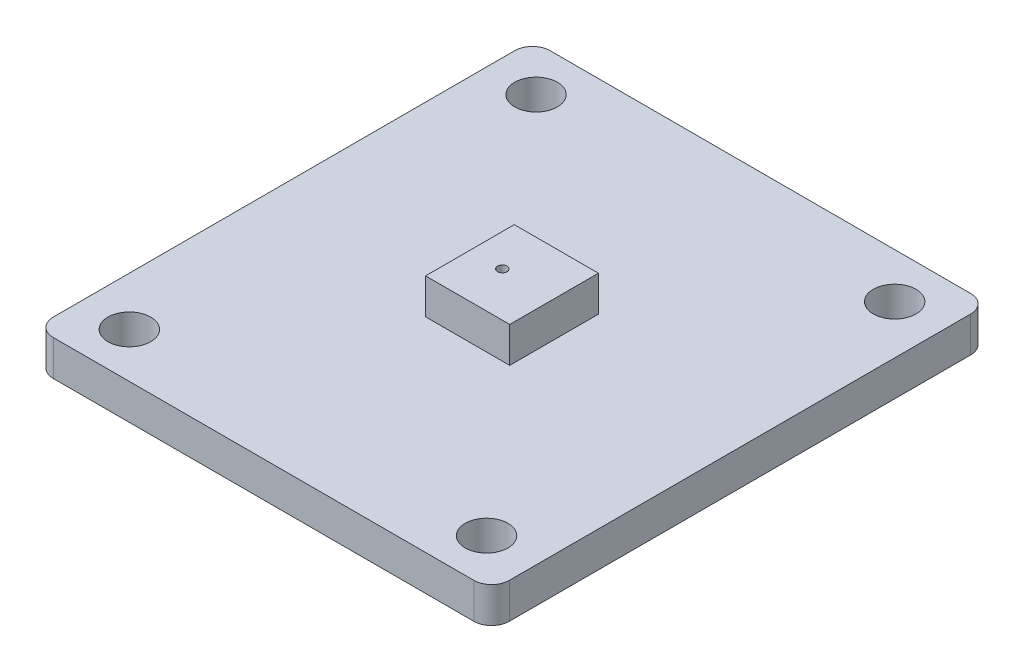
ISO-10303-21;
HEADER;
FILE_DESCRIPTION(('STEP AP214'),'2;1');
FILE_NAME('part.step','',(''),(''),'','','');
FILE_SCHEMA(('AUTOMOTIVE_DESIGN { 1 0 10303 214 1 1 1 1 }'));
ENDSEC;
DATA;
#1=APPLICATION_CONTEXT('core data for automotive mechanical design processes');
#2=APPLICATION_PROTOCOL_DEFINITION('international standard','automotive_design',2000,#1);
#3=PRODUCT_CONTEXT('',#1,'mechanical');
#4=PRODUCT('Part','Part','',(#3));
#5=PRODUCT_RELATED_PRODUCT_CATEGORY('part','',(#4));
#6=PRODUCT_DEFINITION_FORMATION('','',#4);
#7=PRODUCT_DEFINITION_CONTEXT('part definition',#1,'design');
#8=PRODUCT_DEFINITION('design','',#6,#7);
#9=PRODUCT_DEFINITION_SHAPE('','',#8);
#10=(LENGTH_UNIT() NAMED_UNIT(*) SI_UNIT(.MILLI.,.METRE.));
#11=(NAMED_UNIT(*) PLANE_ANGLE_UNIT() SI_UNIT($,.RADIAN.));
#12=(NAMED_UNIT(*) SI_UNIT($,.STERADIAN.) SOLID_ANGLE_UNIT());
#13=UNCERTAINTY_MEASURE_WITH_UNIT(LENGTH_MEASURE(1.E-05),#10,'distance_accuracy_value','');
#14=(GEOMETRIC_REPRESENTATION_CONTEXT(3) GLOBAL_UNCERTAINTY_ASSIGNED_CONTEXT((#13)) GLOBAL_UNIT_ASSIGNED_CONTEXT((#10,
#11,#12)) REPRESENTATION_CONTEXT('',''));
#15=CARTESIAN_POINT('',(0.,0.,0.));
#16=DIRECTION('',(0.,0.,1.));
#17=DIRECTION('',(1.,0.,0.));
#18=AXIS2_PLACEMENT_3D('',#15,#16,#17);
#19=CARTESIAN_POINT('',(-11.85,2.,13.));
#20=DIRECTION('',(0.,1.,0.));
#21=DIRECTION('',(0.,0.,1.));
#22=AXIS2_PLACEMENT_3D('',#19,#20,#21);
#23=PLANE('',#22);
#24=DIRECTION('',(-1.,0.,0.));
#25=VECTOR('',#24,1.);
#26=CARTESIAN_POINT('',(-11.85,2.,2.5));
#27=LINE('',#26,#25);
#28=CARTESIAN_POINT('',(2.37,2.,2.5));
#29=VERTEX_POINT('',#28);
#30=CARTESIAN_POINT('',(-2.36999999999999,2.,2.5));
#31=VERTEX_POINT('',#30);
#32=EDGE_CURVE('E222',#29,#31,#27,.T.);
#33=ORIENTED_EDGE('',*,*,#32,.T.);
#34=DIRECTION('',(0.,0.,-1.));
#35=VECTOR('',#34,1.);
#36=CARTESIAN_POINT('',(-2.36999999999999,2.,13.));
#37=LINE('',#36,#35);
#38=CARTESIAN_POINT('',(-2.36999999999999,2.,-2.5));
#39=VERTEX_POINT('',#38);
#40=EDGE_CURVE('E217',#31,#39,#37,.T.);
#41=ORIENTED_EDGE('',*,*,#40,.T.);
#42=DIRECTION('',(1.,0.,0.));
#43=VECTOR('',#42,1.);
#44=CARTESIAN_POINT('',(-11.85,2.,-2.5));
#45=LINE('',#44,#43);
#46=CARTESIAN_POINT('',(2.37,2.,-2.5));
#47=VERTEX_POINT('',#46);
#48=EDGE_CURVE('E228',#39,#47,#45,.T.);
#49=ORIENTED_EDGE('',*,*,#48,.T.);
#50=DIRECTION('',(0.,0.,1.));
#51=VECTOR('',#50,1.);
#52=CARTESIAN_POINT('',(2.37,2.,13.));
#53=LINE('',#52,#51);
#54=EDGE_CURVE('E225',#47,#29,#53,.T.);
#55=ORIENTED_EDGE('',*,*,#54,.T.);
#56=EDGE_LOOP('',(#33,#41,#49,#55));
#57=FACE_BOUND('',#56,.T.);
#58=CARTESIAN_POINT('',(10.026555831626,2.,11.46));
#59=DIRECTION('',(0.,1.,0.));
#60=DIRECTION('',(0.,0.,1.));
#61=AXIS2_PLACEMENT_3D('',#58,#59,#60);
#62=CIRCLE('',#61,1.205);
#63=CARTESIAN_POINT('',(10.026555831626,2.,12.665));
#64=VERTEX_POINT('',#63);
#65=EDGE_CURVE('E205',#64,#64,#62,.T.);
#66=ORIENTED_EDGE('',*,*,#65,.F.);
#67=EDGE_LOOP('',(#66));
#68=FACE_BOUND('',#67,.T.);
#69=CARTESIAN_POINT('',(-10.105,2.,-11.46));
#70=DIRECTION('',(0.,1.,0.));
#71=DIRECTION('',(0.,0.,1.));
#72=AXIS2_PLACEMENT_3D('',#69,#70,#71);
#73=CIRCLE('',#72,1.205);
#74=CARTESIAN_POINT('',(-10.105,2.,-10.255));
#75=VERTEX_POINT('',#74);
#76=EDGE_CURVE('E147',#75,#75,#73,.T.);
#77=ORIENTED_EDGE('',*,*,#76,.F.);
#78=EDGE_LOOP('',(#77));
#79=FACE_BOUND('',#78,.T.);
#80=CARTESIAN_POINT('',(-11.85,2.,13.));
#81=DIRECTION('',(0.,1.,0.));
#82=DIRECTION('',(0.,0.,1.));
#83=AXIS2_PLACEMENT_3D('',#80,#81,#82);
#84=CIRCLE('',#83,1.);
#85=CARTESIAN_POINT('',(-12.85,2.,13.));
#86=VERTEX_POINT('',#85);
#87=CARTESIAN_POINT('',(-11.85,2.,14.));
#88=VERTEX_POINT('',#87);
#89=EDGE_CURVE('E159',#86,#88,#84,.T.);
#90=ORIENTED_EDGE('',*,*,#89,.T.);
#91=DIRECTION('',(1.,0.,0.));
#92=VECTOR('',#91,1.);
#93=CARTESIAN_POINT('',(-11.85,2.,14.));
#94=LINE('',#93,#92);
#95=CARTESIAN_POINT('',(11.85,2.,14.));
#96=VERTEX_POINT('',#95);
#97=EDGE_CURVE('E100',#88,#96,#94,.T.);
#98=ORIENTED_EDGE('',*,*,#97,.T.);
#99=CARTESIAN_POINT('',(11.85,2.,13.));
#100=DIRECTION('',(0.,1.,0.));
#101=DIRECTION('',(0.,0.,1.));
#102=AXIS2_PLACEMENT_3D('',#99,#100,#101);
#103=CIRCLE('',#102,1.);
#104=CARTESIAN_POINT('',(12.85,2.,13.));
#105=VERTEX_POINT('',#104);
#106=EDGE_CURVE('E190',#96,#105,#103,.T.);
#107=ORIENTED_EDGE('',*,*,#106,.T.);
#108=DIRECTION('',(0.,0.,-1.));
#109=VECTOR('',#108,1.);
#110=CARTESIAN_POINT('',(12.85,2.,-13.));
#111=LINE('',#110,#109);
#112=CARTESIAN_POINT('',(12.85,2.,-13.));
#113=VERTEX_POINT('',#112);
#114=EDGE_CURVE('E189',#105,#113,#111,.T.);
#115=ORIENTED_EDGE('',*,*,#114,.T.);
#116=CARTESIAN_POINT('',(11.85,2.,-13.));
#117=DIRECTION('',(0.,1.,0.));
#118=DIRECTION('',(0.,0.,-1.));
#119=AXIS2_PLACEMENT_3D('',#116,#117,#118);
#120=CIRCLE('',#119,1.);
#121=CARTESIAN_POINT('',(11.85,2.,-14.));
#122=VERTEX_POINT('',#121);
#123=EDGE_CURVE('E122',#113,#122,#120,.T.);
#124=ORIENTED_EDGE('',*,*,#123,.T.);
#125=DIRECTION('',(-1.,0.,0.));
#126=VECTOR('',#125,1.);
#127=CARTESIAN_POINT('',(-11.85,2.,-14.));
#128=LINE('',#127,#126);
#129=CARTESIAN_POINT('',(-11.85,2.,-14.));
#130=VERTEX_POINT('',#129);
#131=EDGE_CURVE('E115',#122,#130,#128,.T.);
#132=ORIENTED_EDGE('',*,*,#131,.T.);
#133=CARTESIAN_POINT('',(-11.85,2.,-13.));
#134=DIRECTION('',(0.,1.,0.));
#135=DIRECTION('',(0.,0.,1.));
#136=AXIS2_PLACEMENT_3D('',#133,#134,#135);
#137=CIRCLE('',#136,1.);
#138=CARTESIAN_POINT('',(-12.85,2.,-13.));
#139=VERTEX_POINT('',#138);
#140=EDGE_CURVE('E119',#130,#139,#137,.T.);
#141=ORIENTED_EDGE('',*,*,#140,.T.);
#142=DIRECTION('',(0.,0.,1.));
#143=VECTOR('',#142,1.);
#144=CARTESIAN_POINT('',(-12.85,2.,-13.));
#145=LINE('',#144,#143);
#146=EDGE_CURVE('E58',#139,#86,#145,.T.);
#147=ORIENTED_EDGE('',*,*,#146,.T.);
#148=EDGE_LOOP('',(#90,#98,#107,#115,#124,#132,#141,#147));
#149=FACE_BOUND('',#148,.T.);
#150=CARTESIAN_POINT('',(-10.105,2.,11.46));
#151=DIRECTION('',(0.,1.,0.));
#152=DIRECTION('',(0.,0.,1.));
#153=AXIS2_PLACEMENT_3D('',#150,#151,#152);
#154=CIRCLE('',#153,1.205);
#155=CARTESIAN_POINT('',(-10.105,2.,12.665));
#156=VERTEX_POINT('',#155);
#157=EDGE_CURVE('E199',#156,#156,#154,.T.);
#158=ORIENTED_EDGE('',*,*,#157,.F.);
#159=EDGE_LOOP('',(#158));
#160=FACE_BOUND('',#159,.T.);
#161=CARTESIAN_POINT('',(10.105,2.,-11.46));
#162=DIRECTION('',(0.,1.,0.));
#163=DIRECTION('',(0.,0.,1.));
#164=AXIS2_PLACEMENT_3D('',#161,#162,#163);
#165=CIRCLE('',#164,1.205);
#166=CARTESIAN_POINT('',(10.105,2.,-10.255));
#167=VERTEX_POINT('',#166);
#168=EDGE_CURVE('E211',#167,#167,#165,.T.);
#169=ORIENTED_EDGE('',*,*,#168,.F.);
#170=EDGE_LOOP('',(#169));
#171=FACE_BOUND('',#170,.T.);
#172=ADVANCED_FACE('F33',(#57,#68,#79,#149,#160,#171),#23,.T.);
#173=CARTESIAN_POINT('',(-11.85,0.,13.));
#174=DIRECTION('',(0.,1.,0.));
#175=DIRECTION('',(0.,0.,1.));
#176=AXIS2_PLACEMENT_3D('',#173,#174,#175);
#177=PLANE('',#176);
#178=CARTESIAN_POINT('',(-11.85,0.,13.));
#179=DIRECTION('',(0.,1.,0.));
#180=DIRECTION('',(0.,0.,1.));
#181=AXIS2_PLACEMENT_3D('',#178,#179,#180);
#182=CIRCLE('',#181,1.);
#183=CARTESIAN_POINT('',(-12.85,0.,13.));
#184=VERTEX_POINT('',#183);
#185=CARTESIAN_POINT('',(-11.85,0.,14.));
#186=VERTEX_POINT('',#185);
#187=EDGE_CURVE('E143',#184,#186,#182,.T.);
#188=ORIENTED_EDGE('',*,*,#187,.F.);
#189=DIRECTION('',(0.,0.,1.));
#190=VECTOR('',#189,1.);
#191=CARTESIAN_POINT('',(-12.85,0.,-13.));
#192=LINE('',#191,#190);
#193=CARTESIAN_POINT('',(-12.85,0.,-13.));
#194=VERTEX_POINT('',#193);
#195=EDGE_CURVE('E91',#194,#184,#192,.T.);
#196=ORIENTED_EDGE('',*,*,#195,.F.);
#197=CARTESIAN_POINT('',(-11.85,0.,-13.));
#198=DIRECTION('',(0.,1.,0.));
#199=DIRECTION('',(0.,0.,1.));
#200=AXIS2_PLACEMENT_3D('',#197,#198,#199);
#201=CIRCLE('',#200,1.);
#202=CARTESIAN_POINT('',(-11.85,0.,-14.));
#203=VERTEX_POINT('',#202);
#204=EDGE_CURVE('E156',#203,#194,#201,.T.);
#205=ORIENTED_EDGE('',*,*,#204,.F.);
#206=DIRECTION('',(-1.,0.,0.));
#207=VECTOR('',#206,1.);
#208=CARTESIAN_POINT('',(-11.85,0.,-14.));
#209=LINE('',#208,#207);
#210=CARTESIAN_POINT('',(11.85,0.,-14.));
#211=VERTEX_POINT('',#210);
#212=EDGE_CURVE('E131',#211,#203,#209,.T.);
#213=ORIENTED_EDGE('',*,*,#212,.F.);
#214=CARTESIAN_POINT('',(11.85,0.,-13.));
#215=DIRECTION('',(0.,1.,0.));
#216=DIRECTION('',(0.,0.,-1.));
#217=AXIS2_PLACEMENT_3D('',#214,#215,#216);
#218=CIRCLE('',#217,1.);
#219=CARTESIAN_POINT('',(12.85,0.,-13.));
#220=VERTEX_POINT('',#219);
#221=EDGE_CURVE('E153',#220,#211,#218,.T.);
#222=ORIENTED_EDGE('',*,*,#221,.F.);
#223=DIRECTION('',(0.,0.,-1.));
#224=VECTOR('',#223,1.);
#225=CARTESIAN_POINT('',(12.85,0.,-13.));
#226=LINE('',#225,#224);
#227=CARTESIAN_POINT('',(12.85,0.,13.));
#228=VERTEX_POINT('',#227);
#229=EDGE_CURVE('E151',#228,#220,#226,.T.);
#230=ORIENTED_EDGE('',*,*,#229,.F.);
#231=CARTESIAN_POINT('',(11.85,0.,13.));
#232=DIRECTION('',(0.,1.,0.));
#233=DIRECTION('',(0.,0.,1.));
#234=AXIS2_PLACEMENT_3D('',#231,#232,#233);
#235=CIRCLE('',#234,1.);
#236=CARTESIAN_POINT('',(11.85,0.,14.));
#237=VERTEX_POINT('',#236);
#238=EDGE_CURVE('E149',#237,#228,#235,.T.);
#239=ORIENTED_EDGE('',*,*,#238,.F.);
#240=DIRECTION('',(1.,0.,0.));
#241=VECTOR('',#240,1.);
#242=CARTESIAN_POINT('',(-11.85,0.,14.));
#243=LINE('',#242,#241);
#244=EDGE_CURVE('E146',#186,#237,#243,.T.);
#245=ORIENTED_EDGE('',*,*,#244,.F.);
#246=EDGE_LOOP('',(#188,#196,#205,#213,#222,#230,#239,#245));
#247=FACE_BOUND('',#246,.T.);
#248=CARTESIAN_POINT('',(-10.105,0.,-11.46));
#249=DIRECTION('',(0.,1.,0.));
#250=DIRECTION('',(0.,0.,1.));
#251=AXIS2_PLACEMENT_3D('',#248,#249,#250);
#252=CIRCLE('',#251,1.205);
#253=CARTESIAN_POINT('',(-10.105,0.,-10.255));
#254=VERTEX_POINT('',#253);
#255=EDGE_CURVE('E196',#254,#254,#252,.T.);
#256=ORIENTED_EDGE('',*,*,#255,.T.);
#257=EDGE_LOOP('',(#256));
#258=FACE_BOUND('',#257,.T.);
#259=CARTESIAN_POINT('',(-10.105,0.,11.46));
#260=DIRECTION('',(0.,1.,0.));
#261=DIRECTION('',(0.,0.,1.));
#262=AXIS2_PLACEMENT_3D('',#259,#260,#261);
#263=CIRCLE('',#262,1.205);
#264=CARTESIAN_POINT('',(-10.105,0.,12.665));
#265=VERTEX_POINT('',#264);
#266=EDGE_CURVE('E202',#265,#265,#263,.T.);
#267=ORIENTED_EDGE('',*,*,#266,.T.);
#268=EDGE_LOOP('',(#267));
#269=FACE_BOUND('',#268,.T.);
#270=CARTESIAN_POINT('',(10.026555831626,0.,11.46));
#271=DIRECTION('',(0.,1.,0.));
#272=DIRECTION('',(0.,0.,1.));
#273=AXIS2_PLACEMENT_3D('',#270,#271,#272);
#274=CIRCLE('',#273,1.205);
#275=CARTESIAN_POINT('',(10.026555831626,0.,12.665));
#276=VERTEX_POINT('',#275);
#277=EDGE_CURVE('E208',#276,#276,#274,.T.);
#278=ORIENTED_EDGE('',*,*,#277,.T.);
#279=EDGE_LOOP('',(#278));
#280=FACE_BOUND('',#279,.T.);
#281=CARTESIAN_POINT('',(10.105,0.,-11.46));
#282=DIRECTION('',(0.,1.,0.));
#283=DIRECTION('',(0.,0.,1.));
#284=AXIS2_PLACEMENT_3D('',#281,#282,#283);
#285=CIRCLE('',#284,1.205);
#286=CARTESIAN_POINT('',(10.105,0.,-10.255));
#287=VERTEX_POINT('',#286);
#288=EDGE_CURVE('E214',#287,#287,#285,.T.);
#289=ORIENTED_EDGE('',*,*,#288,.T.);
#290=EDGE_LOOP('',(#289));
#291=FACE_BOUND('',#290,.T.);
#292=ADVANCED_FACE('F179',(#247,#258,#269,#280,#291),#177,.F.);
#293=CARTESIAN_POINT('',(-11.85,2.,13.));
#294=DIRECTION('',(0.,-1.,0.));
#295=DIRECTION('',(0.,0.,-1.));
#296=AXIS2_PLACEMENT_3D('',#293,#294,#295);
#297=CYLINDRICAL_SURFACE('',#296,1.);
#298=ORIENTED_EDGE('',*,*,#187,.T.);
#299=DIRECTION('',(0.,-1.,0.));
#300=VECTOR('',#299,1.);
#301=CARTESIAN_POINT('',(-11.85,2.,14.));
#302=LINE('',#301,#300);
#303=EDGE_CURVE('E37',#88,#186,#302,.T.);
#304=ORIENTED_EDGE('',*,*,#303,.F.);
#305=ORIENTED_EDGE('',*,*,#89,.F.);
#306=DIRECTION('',(0.,-1.,0.));
#307=VECTOR('',#306,1.);
#308=CARTESIAN_POINT('',(-12.85,2.,13.));
#309=LINE('',#308,#307);
#310=EDGE_CURVE('E139',#86,#184,#309,.T.);
#311=ORIENTED_EDGE('',*,*,#310,.T.);
#312=EDGE_LOOP('',(#298,#304,#305,#311));
#313=FACE_BOUND('',#312,.T.);
#314=ADVANCED_FACE('F35',(#313),#297,.T.);
#315=CARTESIAN_POINT('',(-11.85,2.,14.));
#316=DIRECTION('',(0.,0.,-1.));
#317=DIRECTION('',(-1.,0.,0.));
#318=AXIS2_PLACEMENT_3D('',#315,#316,#317);
#319=PLANE('',#318);
#320=ORIENTED_EDGE('',*,*,#244,.T.);
#321=DIRECTION('',(0.,-1.,0.));
#322=VECTOR('',#321,1.);
#323=CARTESIAN_POINT('',(11.85,2.,14.));
#324=LINE('',#323,#322);
#325=EDGE_CURVE('E168',#96,#237,#324,.T.);
#326=ORIENTED_EDGE('',*,*,#325,.F.);
#327=ORIENTED_EDGE('',*,*,#97,.F.);
#328=ORIENTED_EDGE('',*,*,#303,.T.);
#329=EDGE_LOOP('',(#320,#326,#327,#328));
#330=FACE_BOUND('',#329,.T.);
#331=ADVANCED_FACE('F174',(#330),#319,.F.);
#332=CARTESIAN_POINT('',(11.85,2.,13.));
#333=DIRECTION('',(0.,-1.,0.));
#334=DIRECTION('',(0.,0.,-1.));
#335=AXIS2_PLACEMENT_3D('',#332,#333,#334);
#336=CYLINDRICAL_SURFACE('',#335,1.);
#337=ORIENTED_EDGE('',*,*,#238,.T.);
#338=DIRECTION('',(0.,-1.,0.));
#339=VECTOR('',#338,1.);
#340=CARTESIAN_POINT('',(12.85,2.,13.));
#341=LINE('',#340,#339);
#342=EDGE_CURVE('E166',#105,#228,#341,.T.);
#343=ORIENTED_EDGE('',*,*,#342,.F.);
#344=ORIENTED_EDGE('',*,*,#106,.F.);
#345=ORIENTED_EDGE('',*,*,#325,.T.);
#346=EDGE_LOOP('',(#337,#343,#344,#345));
#347=FACE_BOUND('',#346,.T.);
#348=ADVANCED_FACE('F184',(#347),#336,.T.);
#349=CARTESIAN_POINT('',(12.85,2.,-13.));
#350=DIRECTION('',(-1.,0.,0.));
#351=DIRECTION('',(0.,0.,1.));
#352=AXIS2_PLACEMENT_3D('',#349,#350,#351);
#353=PLANE('',#352);
#354=ORIENTED_EDGE('',*,*,#229,.T.);
#355=DIRECTION('',(0.,-1.,0.));
#356=VECTOR('',#355,1.);
#357=CARTESIAN_POINT('',(12.85,2.,-13.));
#358=LINE('',#357,#356);
#359=EDGE_CURVE('E163',#113,#220,#358,.T.);
#360=ORIENTED_EDGE('',*,*,#359,.F.);
#361=ORIENTED_EDGE('',*,*,#114,.F.);
#362=ORIENTED_EDGE('',*,*,#342,.T.);
#363=EDGE_LOOP('',(#354,#360,#361,#362));
#364=FACE_BOUND('',#363,.T.);
#365=ADVANCED_FACE('F187',(#364),#353,.F.);
#366=CARTESIAN_POINT('',(11.85,2.,-13.));
#367=DIRECTION('',(0.,-1.,0.));
#368=DIRECTION('',(0.,0.,-1.));
#369=AXIS2_PLACEMENT_3D('',#366,#367,#368);
#370=CYLINDRICAL_SURFACE('',#369,1.);
#371=ORIENTED_EDGE('',*,*,#221,.T.);
#372=DIRECTION('',(0.,-1.,0.));
#373=VECTOR('',#372,1.);
#374=CARTESIAN_POINT('',(11.85,2.,-14.));
#375=LINE('',#374,#373);
#376=EDGE_CURVE('E134',#122,#211,#375,.T.);
#377=ORIENTED_EDGE('',*,*,#376,.F.);
#378=ORIENTED_EDGE('',*,*,#123,.F.);
#379=ORIENTED_EDGE('',*,*,#359,.T.);
#380=EDGE_LOOP('',(#371,#377,#378,#379));
#381=FACE_BOUND('',#380,.T.);
#382=ADVANCED_FACE('F342',(#381),#370,.T.);
#383=CARTESIAN_POINT('',(-11.85,2.,-14.));
#384=DIRECTION('',(0.,0.,1.));
#385=DIRECTION('',(1.,0.,0.));
#386=AXIS2_PLACEMENT_3D('',#383,#384,#385);
#387=PLANE('',#386);
#388=ORIENTED_EDGE('',*,*,#212,.T.);
#389=DIRECTION('',(0.,-1.,0.));
#390=VECTOR('',#389,1.);
#391=CARTESIAN_POINT('',(-11.85,2.,-14.));
#392=LINE('',#391,#390);
#393=EDGE_CURVE('E128',#130,#203,#392,.T.);
#394=ORIENTED_EDGE('',*,*,#393,.F.);
#395=ORIENTED_EDGE('',*,*,#131,.F.);
#396=ORIENTED_EDGE('',*,*,#376,.T.);
#397=EDGE_LOOP('',(#388,#394,#395,#396));
#398=FACE_BOUND('',#397,.T.);
#399=ADVANCED_FACE('F129',(#398),#387,.F.);
#400=CARTESIAN_POINT('',(-11.85,2.,-13.));
#401=DIRECTION('',(0.,-1.,0.));
#402=DIRECTION('',(0.,0.,-1.));
#403=AXIS2_PLACEMENT_3D('',#400,#401,#402);
#404=CYLINDRICAL_SURFACE('',#403,1.);
#405=ORIENTED_EDGE('',*,*,#204,.T.);
#406=DIRECTION('',(0.,-1.,0.));
#407=VECTOR('',#406,1.);
#408=CARTESIAN_POINT('',(-12.85,2.,-13.));
#409=LINE('',#408,#407);
#410=EDGE_CURVE('E135',#139,#194,#409,.T.);
#411=ORIENTED_EDGE('',*,*,#410,.F.);
#412=ORIENTED_EDGE('',*,*,#140,.F.);
#413=ORIENTED_EDGE('',*,*,#393,.T.);
#414=EDGE_LOOP('',(#405,#411,#412,#413));
#415=FACE_BOUND('',#414,.T.);
#416=ADVANCED_FACE('F137',(#415),#404,.T.);
#417=CARTESIAN_POINT('',(-12.85,2.,-13.));
#418=DIRECTION('',(1.,0.,0.));
#419=DIRECTION('',(0.,0.,-1.));
#420=AXIS2_PLACEMENT_3D('',#417,#418,#419);
#421=PLANE('',#420);
#422=ORIENTED_EDGE('',*,*,#195,.T.);
#423=ORIENTED_EDGE('',*,*,#310,.F.);
#424=ORIENTED_EDGE('',*,*,#146,.F.);
#425=ORIENTED_EDGE('',*,*,#410,.T.);
#426=EDGE_LOOP('',(#422,#423,#424,#425));
#427=FACE_BOUND('',#426,.T.);
#428=ADVANCED_FACE('F316',(#427),#421,.F.);
#429=CARTESIAN_POINT('',(-10.105,2.,-11.46));
#430=DIRECTION('',(0.,-1.,0.));
#431=DIRECTION('',(0.,0.,-1.));
#432=AXIS2_PLACEMENT_3D('',#429,#430,#431);
#433=CYLINDRICAL_SURFACE('',#432,1.205);
#434=ORIENTED_EDGE('',*,*,#76,.T.);
#435=EDGE_LOOP('',(#434));
#436=FACE_BOUND('',#435,.T.);
#437=ORIENTED_EDGE('',*,*,#255,.F.);
#438=EDGE_LOOP('',(#437));
#439=FACE_BOUND('',#438,.T.);
#440=ADVANCED_FACE('F313',(#436,#439),#433,.F.);
#441=CARTESIAN_POINT('',(-10.105,2.,11.46));
#442=DIRECTION('',(0.,-1.,0.));
#443=DIRECTION('',(0.,0.,-1.));
#444=AXIS2_PLACEMENT_3D('',#441,#442,#443);
#445=CYLINDRICAL_SURFACE('',#444,1.205);
#446=ORIENTED_EDGE('',*,*,#157,.T.);
#447=EDGE_LOOP('',(#446));
#448=FACE_BOUND('',#447,.T.);
#449=ORIENTED_EDGE('',*,*,#266,.F.);
#450=EDGE_LOOP('',(#449));
#451=FACE_BOUND('',#450,.T.);
#452=ADVANCED_FACE('F310',(#448,#451),#445,.F.);
#453=CARTESIAN_POINT('',(10.026555831626,2.,11.46));
#454=DIRECTION('',(0.,-1.,0.));
#455=DIRECTION('',(0.,0.,-1.));
#456=AXIS2_PLACEMENT_3D('',#453,#454,#455);
#457=CYLINDRICAL_SURFACE('',#456,1.205);
#458=ORIENTED_EDGE('',*,*,#65,.T.);
#459=EDGE_LOOP('',(#458));
#460=FACE_BOUND('',#459,.T.);
#461=ORIENTED_EDGE('',*,*,#277,.F.);
#462=EDGE_LOOP('',(#461));
#463=FACE_BOUND('',#462,.T.);
#464=ADVANCED_FACE('F272',(#460,#463),#457,.F.);
#465=CARTESIAN_POINT('',(10.105,2.,-11.46));
#466=DIRECTION('',(0.,-1.,0.));
#467=DIRECTION('',(0.,0.,-1.));
#468=AXIS2_PLACEMENT_3D('',#465,#466,#467);
#469=CYLINDRICAL_SURFACE('',#468,1.205);
#470=ORIENTED_EDGE('',*,*,#168,.T.);
#471=EDGE_LOOP('',(#470));
#472=FACE_BOUND('',#471,.T.);
#473=ORIENTED_EDGE('',*,*,#288,.F.);
#474=EDGE_LOOP('',(#473));
#475=FACE_BOUND('',#474,.T.);
#476=ADVANCED_FACE('F262',(#472,#475),#469,.F.);
#477=CARTESIAN_POINT('',(0.,4.,0.));
#478=DIRECTION('',(0.,1.,0.));
#479=DIRECTION('',(0.,0.,1.));
#480=AXIS2_PLACEMENT_3D('',#477,#478,#479);
#481=PLANE('',#480);
#482=DIRECTION('',(0.,0.,1.));
#483=VECTOR('',#482,1.);
#484=CARTESIAN_POINT('',(-2.36999999999999,4.,-2.5));
#485=LINE('',#484,#483);
#486=CARTESIAN_POINT('',(-2.36999999999999,4.,-2.5));
#487=VERTEX_POINT('',#486);
#488=CARTESIAN_POINT('',(-2.36999999999999,4.,2.5));
#489=VERTEX_POINT('',#488);
#490=EDGE_CURVE('E250',#487,#489,#485,.T.);
#491=ORIENTED_EDGE('',*,*,#490,.T.);
#492=DIRECTION('',(1.,0.,0.));
#493=VECTOR('',#492,1.);
#494=CARTESIAN_POINT('',(-2.36999999999999,4.,2.5));
#495=LINE('',#494,#493);
#496=CARTESIAN_POINT('',(2.37,4.,2.5));
#497=VERTEX_POINT('',#496);
#498=EDGE_CURVE('E247',#489,#497,#495,.T.);
#499=ORIENTED_EDGE('',*,*,#498,.T.);
#500=DIRECTION('',(0.,0.,-1.));
#501=VECTOR('',#500,1.);
#502=CARTESIAN_POINT('',(2.37,4.,-2.5));
#503=LINE('',#502,#501);
#504=CARTESIAN_POINT('',(2.37,4.,-2.5));
#505=VERTEX_POINT('',#504);
#506=EDGE_CURVE('E244',#497,#505,#503,.T.);
#507=ORIENTED_EDGE('',*,*,#506,.T.);
#508=DIRECTION('',(-1.,0.,0.));
#509=VECTOR('',#508,1.);
#510=CARTESIAN_POINT('',(-2.36999999999999,4.,-2.5));
#511=LINE('',#510,#509);
#512=EDGE_CURVE('E241',#505,#487,#511,.T.);
#513=ORIENTED_EDGE('',*,*,#512,.T.);
#514=EDGE_LOOP('',(#491,#499,#507,#513));
#515=FACE_BOUND('',#514,.T.);
#516=CARTESIAN_POINT('',(-0.548413106138271,4.,0.));
#517=DIRECTION('',(0.,1.,0.));
#518=DIRECTION('',(0.,0.,1.));
#519=AXIS2_PLACEMENT_3D('',#516,#517,#518);
#520=CIRCLE('',#519,0.2717582312594);
#521=CARTESIAN_POINT('',(-0.548413106138271,4.,0.2717582312594));
#522=VERTEX_POINT('',#521);
#523=EDGE_CURVE('E253',#522,#522,#520,.T.);
#524=ORIENTED_EDGE('',*,*,#523,.F.);
#525=EDGE_LOOP('',(#524));
#526=FACE_BOUND('',#525,.T.);
#527=ADVANCED_FACE('F259',(#515,#526),#481,.T.);
#528=CARTESIAN_POINT('',(-2.36999999999999,4.,-2.5));
#529=DIRECTION('',(1.,0.,0.));
#530=DIRECTION('',(0.,0.,-1.));
#531=AXIS2_PLACEMENT_3D('',#528,#529,#530);
#532=PLANE('',#531);
#533=ORIENTED_EDGE('',*,*,#40,.F.);
#534=DIRECTION('',(0.,-1.,0.));
#535=VECTOR('',#534,1.);
#536=CARTESIAN_POINT('',(-2.36999999999999,4.,2.5));
#537=LINE('',#536,#535);
#538=EDGE_CURVE('E230',#489,#31,#537,.T.);
#539=ORIENTED_EDGE('',*,*,#538,.F.);
#540=ORIENTED_EDGE('',*,*,#490,.F.);
#541=DIRECTION('',(0.,-1.,0.));
#542=VECTOR('',#541,1.);
#543=CARTESIAN_POINT('',(-2.36999999999999,4.,-2.5));
#544=LINE('',#543,#542);
#545=EDGE_CURVE('E238',#487,#39,#544,.T.);
#546=ORIENTED_EDGE('',*,*,#545,.T.);
#547=EDGE_LOOP('',(#533,#539,#540,#546));
#548=FACE_BOUND('',#547,.T.);
#549=ADVANCED_FACE('F261',(#548),#532,.F.);
#550=CARTESIAN_POINT('',(-2.36999999999999,4.,2.5));
#551=DIRECTION('',(0.,0.,-1.));
#552=DIRECTION('',(-1.,0.,0.));
#553=AXIS2_PLACEMENT_3D('',#550,#551,#552);
#554=PLANE('',#553);
#555=ORIENTED_EDGE('',*,*,#32,.F.);
#556=DIRECTION('',(0.,-1.,0.));
#557=VECTOR('',#556,1.);
#558=CARTESIAN_POINT('',(2.37,4.,2.5));
#559=LINE('',#558,#557);
#560=EDGE_CURVE('E234',#497,#29,#559,.T.);
#561=ORIENTED_EDGE('',*,*,#560,.F.);
#562=ORIENTED_EDGE('',*,*,#498,.F.);
#563=ORIENTED_EDGE('',*,*,#538,.T.);
#564=EDGE_LOOP('',(#555,#561,#562,#563));
#565=FACE_BOUND('',#564,.T.);
#566=ADVANCED_FACE('F269',(#565),#554,.F.);
#567=CARTESIAN_POINT('',(2.37,4.,-2.5));
#568=DIRECTION('',(-1.,0.,0.));
#569=DIRECTION('',(0.,0.,1.));
#570=AXIS2_PLACEMENT_3D('',#567,#568,#569);
#571=PLANE('',#570);
#572=ORIENTED_EDGE('',*,*,#54,.F.);
#573=DIRECTION('',(0.,-1.,0.));
#574=VECTOR('',#573,1.);
#575=CARTESIAN_POINT('',(2.37,4.,-2.5));
#576=LINE('',#575,#574);
#577=EDGE_CURVE('E49',#505,#47,#576,.T.);
#578=ORIENTED_EDGE('',*,*,#577,.F.);
#579=ORIENTED_EDGE('',*,*,#506,.F.);
#580=ORIENTED_EDGE('',*,*,#560,.T.);
#581=EDGE_LOOP('',(#572,#578,#579,#580));
#582=FACE_BOUND('',#581,.T.);
#583=ADVANCED_FACE('F298',(#582),#571,.F.);
#584=CARTESIAN_POINT('',(-2.36999999999999,4.,-2.5));
#585=DIRECTION('',(0.,0.,1.));
#586=DIRECTION('',(1.,0.,0.));
#587=AXIS2_PLACEMENT_3D('',#584,#585,#586);
#588=PLANE('',#587);
#589=ORIENTED_EDGE('',*,*,#48,.F.);
#590=ORIENTED_EDGE('',*,*,#545,.F.);
#591=ORIENTED_EDGE('',*,*,#512,.F.);
#592=ORIENTED_EDGE('',*,*,#577,.T.);
#593=EDGE_LOOP('',(#589,#590,#591,#592));
#594=FACE_BOUND('',#593,.T.);
#595=ADVANCED_FACE('F292',(#594),#588,.F.);
#596=CARTESIAN_POINT('',(-0.548413106138271,4.,0.));
#597=DIRECTION('',(0.,-1.,0.));
#598=DIRECTION('',(0.,0.,-1.));
#599=AXIS2_PLACEMENT_3D('',#596,#597,#598);
#600=CYLINDRICAL_SURFACE('',#599,0.2717582312594);
#601=CARTESIAN_POINT('',(-0.548413106138271,2.,0.));
#602=DIRECTION('',(0.,1.,0.));
#603=DIRECTION('',(0.,0.,1.));
#604=AXIS2_PLACEMENT_3D('',#601,#602,#603);
#605=CIRCLE('',#604,0.2717582312594);
#606=CARTESIAN_POINT('',(-0.548413106138271,2.,0.2717582312594));
#607=VERTEX_POINT('',#606);
#608=EDGE_CURVE('E11',#607,#607,#605,.F.);
#609=ORIENTED_EDGE('',*,*,#608,.T.);
#610=EDGE_LOOP('',(#609));
#611=FACE_BOUND('',#610,.T.);
#612=ORIENTED_EDGE('',*,*,#523,.T.);
#613=EDGE_LOOP('',(#612));
#614=FACE_BOUND('',#613,.T.);
#615=ADVANCED_FACE('F257',(#611,#614),#600,.F.);
#616=ORIENTED_EDGE('',*,*,#608,.F.);
#617=EDGE_LOOP('',(#616));
#618=FACE_BOUND('',#617,.T.);
#619=ADVANCED_FACE('F280',(#618),#23,.T.);
#620=CLOSED_SHELL('',(#172,#292,#314,#331,#348,#365,#382,#399,#416,#428,#440,#452,#464,#476,
#527,#549,#566,#583,#595,#615,#619));
#621=MANIFOLD_SOLID_BREP('B2',#620);
#622=ADVANCED_BREP_SHAPE_REPRESENTATION('',(#18,#621),#14);
#623=SHAPE_DEFINITION_REPRESENTATION(#9,#622);
ENDSEC;
END-ISO-10303-21;
